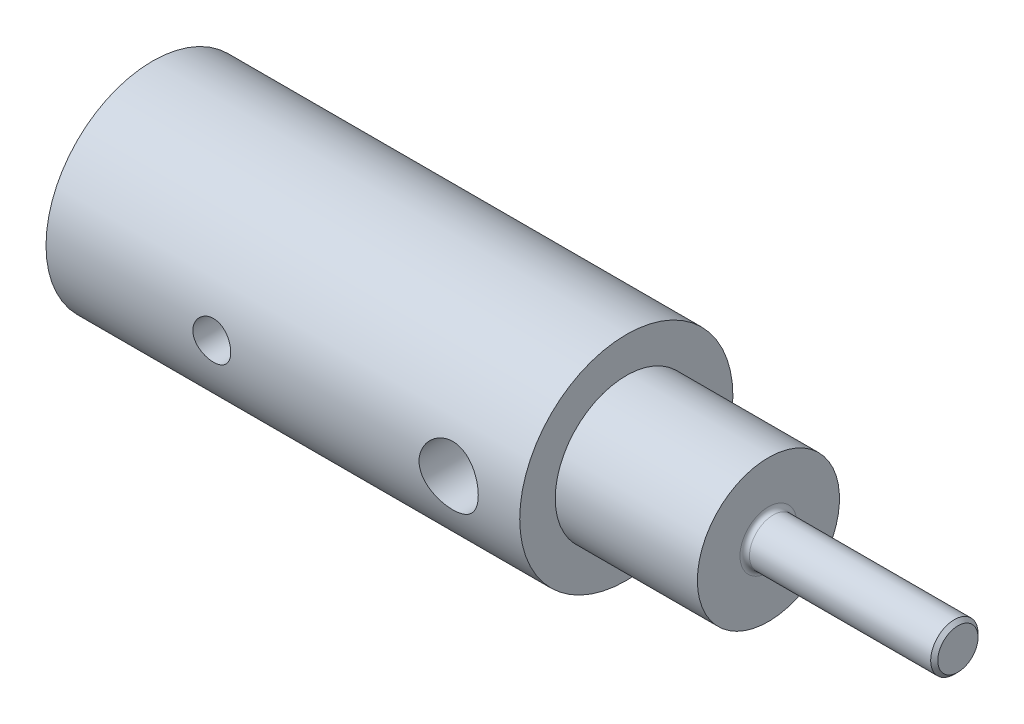
ISO-10303-21;
HEADER;
FILE_DESCRIPTION(('STEP AP214'),'2;1');
FILE_NAME('part.step','',(''),(''),'','','');
FILE_SCHEMA(('AUTOMOTIVE_DESIGN { 1 0 10303 214 1 1 1 1 }'));
ENDSEC;
DATA;
#1=APPLICATION_CONTEXT('core data for automotive mechanical design processes');
#2=APPLICATION_PROTOCOL_DEFINITION('international standard','automotive_design',2000,#1);
#3=PRODUCT_CONTEXT('',#1,'mechanical');
#4=PRODUCT('Part','Part','',(#3));
#5=PRODUCT_RELATED_PRODUCT_CATEGORY('part','',(#4));
#6=PRODUCT_DEFINITION_FORMATION('','',#4);
#7=PRODUCT_DEFINITION_CONTEXT('part definition',#1,'design');
#8=PRODUCT_DEFINITION('design','',#6,#7);
#9=PRODUCT_DEFINITION_SHAPE('','',#8);
#10=(LENGTH_UNIT() NAMED_UNIT(*) SI_UNIT(.MILLI.,.METRE.));
#11=(NAMED_UNIT(*) PLANE_ANGLE_UNIT() SI_UNIT($,.RADIAN.));
#12=(NAMED_UNIT(*) SI_UNIT($,.STERADIAN.) SOLID_ANGLE_UNIT());
#13=UNCERTAINTY_MEASURE_WITH_UNIT(LENGTH_MEASURE(1.E-05),#10,'distance_accuracy_value','');
#14=(GEOMETRIC_REPRESENTATION_CONTEXT(3) GLOBAL_UNCERTAINTY_ASSIGNED_CONTEXT((#13)) GLOBAL_UNIT_ASSIGNED_CONTEXT((#10,
#11,#12)) REPRESENTATION_CONTEXT('',''));
#15=CARTESIAN_POINT('',(0.,0.,0.));
#16=DIRECTION('',(0.,0.,1.));
#17=DIRECTION('',(1.,0.,0.));
#18=AXIS2_PLACEMENT_3D('',#15,#16,#17);
#19=CARTESIAN_POINT('',(0.,0.,0.));
#20=DIRECTION('',(-1.,0.,0.));
#21=DIRECTION('',(0.,0.,1.));
#22=AXIS2_PLACEMENT_3D('',#19,#20,#21);
#23=CYLINDRICAL_SURFACE('',#22,4.5);
#24=CARTESIAN_POINT('',(18.25,0.,-4.5));
#25=CARTESIAN_POINT('',(18.2499986004148,0.0688012508831791,-4.49999908016929));
#26=CARTESIAN_POINT('',(18.2443006801947,0.137617123752667,-4.49840674086833));
#27=CARTESIAN_POINT('',(18.2217042717347,0.273259475994238,-4.49220950198236));
#28=CARTESIAN_POINT('',(18.2048010582863,0.340085103663439,-4.48760333149253));
#29=CARTESIAN_POINT('',(18.1603912805861,0.469769949680302,-4.47588565394594));
#30=CARTESIAN_POINT('',(18.1328990313016,0.53263439009567,-4.46877753030963));
#31=CARTESIAN_POINT('',(18.0681464936731,0.652860695241773,-4.45280312581996));
#32=CARTESIAN_POINT('',(18.0308853380807,0.710222070812298,-4.44393668888688));
#33=CARTESIAN_POINT('',(17.9466705661571,0.819246784715926,-4.4251515781749));
#34=CARTESIAN_POINT('',(17.8995179603125,0.870753112808476,-4.41521373623696));
#35=CARTESIAN_POINT('',(17.7972837228784,0.96523818569634,-4.39552607117256));
#36=CARTESIAN_POINT('',(17.7422009777248,1.00821573084554,-4.38577627467017));
#37=CARTESIAN_POINT('',(17.6243927398707,1.08520808580324,-4.36737044294547));
#38=CARTESIAN_POINT('',(17.5615427915563,1.11903874947837,-4.35873847945984));
#39=CARTESIAN_POINT('',(17.4307680823599,1.1755895713114,-4.34382900808304));
#40=CARTESIAN_POINT('',(17.3628443495918,1.19831197336242,-4.33755102474248));
#41=CARTESIAN_POINT('',(17.2255972111459,1.23144924367956,-4.32825883142877));
#42=CARTESIAN_POINT('',(17.1563481783601,1.24215036904297,-4.32516886003198));
#43=CARTESIAN_POINT('',(17.0169741144372,1.25183427077973,-4.32237649384803));
#44=CARTESIAN_POINT('',(16.9468492651188,1.25081944027303,-4.3226734072502));
#45=CARTESIAN_POINT('',(16.8099777212773,1.2373267133762,-4.32655366801453));
#46=CARTESIAN_POINT('',(16.7431931985038,1.22519902270671,-4.33003660668585));
#47=CARTESIAN_POINT('',(16.6126463714084,1.19038731201905,-4.33973517053475));
#48=CARTESIAN_POINT('',(16.5488843273977,1.16770238457158,-4.3459510306134));
#49=CARTESIAN_POINT('',(16.4252977685447,1.11214373134465,-4.36050069775752));
#50=CARTESIAN_POINT('',(16.3655301331899,1.07915021836991,-4.36885918600197));
#51=CARTESIAN_POINT('',(16.2522584244088,1.00399440679636,-4.386739506843));
#52=CARTESIAN_POINT('',(16.1987556812739,0.961830166290603,-4.39626158564315));
#53=CARTESIAN_POINT('',(16.0975361195636,0.867755610284442,-4.41581072126827));
#54=CARTESIAN_POINT('',(16.0500923651201,0.815552279702357,-4.42584370037791));
#55=CARTESIAN_POINT('',(15.9645742692222,0.703806607201037,-4.44498199810828));
#56=CARTESIAN_POINT('',(15.9265003618975,0.644263925421967,-4.45408727373461));
#57=CARTESIAN_POINT('',(15.8606681843699,0.519083429338117,-4.47040839712755));
#58=CARTESIAN_POINT('',(15.8329628960611,0.45341639574775,-4.47761448645532));
#59=CARTESIAN_POINT('',(15.7890659015586,0.318109988769717,-4.48925492501446));
#60=CARTESIAN_POINT('',(15.7728714578434,0.248471564121132,-4.49368993323699));
#61=CARTESIAN_POINT('',(15.752892863221,0.109526607713143,-4.49918736483408));
#62=CARTESIAN_POINT('',(15.7487378550928,0.0402773058586817,-4.5003505382403));
#63=CARTESIAN_POINT('',(15.7519269982924,-0.0979299306365674,-4.49946480293159));
#64=CARTESIAN_POINT('',(15.759269851648,-0.166887897284519,-4.49741625678167));
#65=CARTESIAN_POINT('',(15.7849433341196,-0.30120691347086,-4.49040265059029));
#66=CARTESIAN_POINT('',(15.8030639450575,-0.366611288163867,-4.4854933716758));
#67=CARTESIAN_POINT('',(15.8495318676381,-0.49344311811872,-4.47331829169354));
#68=CARTESIAN_POINT('',(15.8778803325695,-0.554870123972382,-4.46605222488463));
#69=CARTESIAN_POINT('',(15.9446658780465,-0.673420140405416,-4.44973740284175));
#70=CARTESIAN_POINT('',(15.9833005243227,-0.730427061953541,-4.44065471340565));
#71=CARTESIAN_POINT('',(16.0693161358075,-0.837277670586999,-4.42175477128212));
#72=CARTESIAN_POINT('',(16.1166989800658,-0.887119814631375,-4.41193736105189));
#73=CARTESIAN_POINT('',(16.2206014438783,-0.979812026944952,-4.39229842684379));
#74=CARTESIAN_POINT('',(16.2773574515576,-1.02239957885383,-4.3824860820796));
#75=CARTESIAN_POINT('',(16.3974206378797,-1.09745581429008,-4.36429693304267));
#76=CARTESIAN_POINT('',(16.4607275658426,-1.12992488482463,-4.35592007387163));
#77=CARTESIAN_POINT('',(16.5918071698832,-1.18358105834153,-4.34164798956173));
#78=CARTESIAN_POINT('',(16.6595526377546,-1.20483077484783,-4.3357390309604));
#79=CARTESIAN_POINT('',(16.7978497094168,-1.23557652495357,-4.32707876892783));
#80=CARTESIAN_POINT('',(16.8684005146331,-1.24507587906573,-4.32432657344886));
#81=CARTESIAN_POINT('',(17.0076057794908,-1.25184859974322,-4.32237038329875));
#82=CARTESIAN_POINT('',(17.0762381900119,-1.24954571014582,-4.32304340461176));
#83=CARTESIAN_POINT('',(17.2120948937947,-1.23377143287258,-4.32757137052123));
#84=CARTESIAN_POINT('',(17.2793192292682,-1.22030038049411,-4.33142621959091));
#85=CARTESIAN_POINT('',(17.4098672339181,-1.18282724248615,-4.34180718808003));
#86=CARTESIAN_POINT('',(17.4732208426478,-1.15892214641117,-4.34830866913275));
#87=CARTESIAN_POINT('',(17.5950674225073,-1.10133451670734,-4.36324916052054));
#88=CARTESIAN_POINT('',(17.6535595714857,-1.06765033358688,-4.37168849767404));
#89=CARTESIAN_POINT('',(17.7660276528252,-0.990206962020973,-4.38988810785379));
#90=CARTESIAN_POINT('',(17.8198014766827,-0.946162084346267,-4.39968178982262));
#91=CARTESIAN_POINT('',(17.9193323720535,-0.849781527450664,-4.41930831909362));
#92=CARTESIAN_POINT('',(17.965087452891,-0.797443795628193,-4.4291411755031));
#93=CARTESIAN_POINT('',(18.0483581365781,-0.684460232307883,-4.44801839581548));
#94=CARTESIAN_POINT('',(18.0856516233107,-0.623646258932176,-4.45703841192791));
#95=CARTESIAN_POINT('',(18.1494281392895,-0.496361982692843,-4.47299974900605));
#96=CARTESIAN_POINT('',(18.175917518581,-0.429895030176726,-4.47994229035335));
#97=CARTESIAN_POINT('',(18.2142200807347,-0.303145483766701,-4.4901607483195));
#98=CARTESIAN_POINT('',(18.2276047875929,-0.243364402168742,-4.49382245661855));
#99=CARTESIAN_POINT('',(18.2454948458225,-0.12239262569341,-4.49874234976285));
#100=CARTESIAN_POINT('',(18.2500012449999,-0.0612020980194156,-4.50000081823467));
#101=CARTESIAN_POINT('',(18.25,0.,-4.5));
#102=B_SPLINE_CURVE_WITH_KNOTS('',3,(#24,#25,#26,#27,#28,#29,#30,#31,#32,#33,#34,#35,#36,#37,
#38,#39,#40,#41,#42,#43,#44,#45,#46,#47,#48,#49,#50,#51,#52,#53,#54,#55,#56,#57,#58,#59,#60,#61,
#62,#63,#64,#65,#66,#67,#68,#69,#70,#71,#72,#73,#74,#75,#76,#77,#78,#79,#80,#81,#82,#83,#84,#85,
#86,#87,#88,#89,#90,#91,#92,#93,#94,#95,#96,#97,#98,#99,#100,#101),.UNSPECIFIED.,.T.,.F.,(4,2,2,
2,2,2,2,2,2,2,2,2,2,2,2,2,2,2,2,2,2,2,2,2,2,2,2,2,2,2,2,2,2,2,2,2,2,2,4),(0.,0.20617919309949,
0.412445386147261,0.618433707942855,0.824440322837931,1.03507624325265,1.24574177043995,
1.46037690323672,1.67496866133384,1.88433431939189,2.09365721284145,2.29660232990422,
2.49956489399153,2.70497960040656,2.91043784592675,3.12319493838162,3.33596188658146,
3.5498016563595,3.76359055350007,3.97072010588427,4.17782627748478,4.38102317477487,
4.58424299163039,4.79168948884227,4.99918059600964,5.21305991702851,5.426931056682,
5.63959564853972,5.85220013017267,6.05722599244308,6.26224569952549,6.46539893556025,
6.66858645848129,6.87821913273771,7.0879037754062,7.30258090584733,7.51713167871719,
7.7005598652503,7.88396640253935),.UNSPECIFIED.);
#103=CARTESIAN_POINT('',(18.25,0.,-4.5));
#104=VERTEX_POINT('',#103);
#105=EDGE_CURVE('E235',#104,#104,#102,.T.);
#106=ORIENTED_EDGE('',*,*,#105,.T.);
#107=EDGE_LOOP('',(#106));
#108=FACE_BOUND('',#107,.T.);
#109=CARTESIAN_POINT('',(18.25,0.,4.5));
#110=CARTESIAN_POINT('',(18.2499986004148,-0.0688012508831791,4.49999908016929));
#111=CARTESIAN_POINT('',(18.2443006801947,-0.137617123752667,4.49840674086833));
#112=CARTESIAN_POINT('',(18.2217042717347,-0.273259475994238,4.49220950198236));
#113=CARTESIAN_POINT('',(18.2048010582863,-0.340085103663439,4.48760333149253));
#114=CARTESIAN_POINT('',(18.1603912805861,-0.469769949680302,4.47588565394594));
#115=CARTESIAN_POINT('',(18.1328990313016,-0.53263439009567,4.46877753030963));
#116=CARTESIAN_POINT('',(18.0681464936731,-0.652860695241773,4.45280312581996));
#117=CARTESIAN_POINT('',(18.0308853380807,-0.710222070812298,4.44393668888688));
#118=CARTESIAN_POINT('',(17.9466705661571,-0.819246784715924,4.4251515781749));
#119=CARTESIAN_POINT('',(17.8995179603125,-0.870753112808474,4.41521373623696));
#120=CARTESIAN_POINT('',(17.7972837228784,-0.965238185696338,4.39552607117256));
#121=CARTESIAN_POINT('',(17.7422009777248,-1.00821573084554,4.38577627467017));
#122=CARTESIAN_POINT('',(17.6243927398707,-1.08520808580323,4.36737044294547));
#123=CARTESIAN_POINT('',(17.5615427915563,-1.11903874947837,4.35873847945984));
#124=CARTESIAN_POINT('',(17.4307680823599,-1.1755895713114,4.34382900808304));
#125=CARTESIAN_POINT('',(17.3628443495918,-1.19831197336242,4.33755102474248));
#126=CARTESIAN_POINT('',(17.2255972111459,-1.23144924367956,4.32825883142877));
#127=CARTESIAN_POINT('',(17.1563481783601,-1.24215036904297,4.32516886003198));
#128=CARTESIAN_POINT('',(17.0169741144372,-1.25183427077973,4.32237649384803));
#129=CARTESIAN_POINT('',(16.9468492651188,-1.25081944027303,4.3226734072502));
#130=CARTESIAN_POINT('',(16.8099777212773,-1.2373267133762,4.32655366801453));
#131=CARTESIAN_POINT('',(16.7431931985038,-1.22519902270671,4.33003660668585));
#132=CARTESIAN_POINT('',(16.6126463714084,-1.19038731201905,4.33973517053475));
#133=CARTESIAN_POINT('',(16.5488843273977,-1.16770238457158,4.3459510306134));
#134=CARTESIAN_POINT('',(16.4252977685447,-1.11214373134465,4.36050069775752));
#135=CARTESIAN_POINT('',(16.3655301331899,-1.07915021836991,4.36885918600197));
#136=CARTESIAN_POINT('',(16.2522584244088,-1.00399440679636,4.386739506843));
#137=CARTESIAN_POINT('',(16.1987556812739,-0.961830166290603,4.39626158564315));
#138=CARTESIAN_POINT('',(16.0975361195636,-0.867755610284442,4.41581072126827));
#139=CARTESIAN_POINT('',(16.0500923651201,-0.815552279702357,4.42584370037791));
#140=CARTESIAN_POINT('',(15.9645742692222,-0.703806607201037,4.44498199810828));
#141=CARTESIAN_POINT('',(15.9265003618975,-0.644263925421967,4.45408727373461));
#142=CARTESIAN_POINT('',(15.8606681843699,-0.519083429338117,4.47040839712755));
#143=CARTESIAN_POINT('',(15.8329628960611,-0.45341639574775,4.47761448645532));
#144=CARTESIAN_POINT('',(15.7890659015586,-0.318109988769717,4.48925492501446));
#145=CARTESIAN_POINT('',(15.7728714578434,-0.248471564121132,4.49368993323699));
#146=CARTESIAN_POINT('',(15.752892863221,-0.109526607713143,4.49918736483408));
#147=CARTESIAN_POINT('',(15.7487378550928,-0.0402773058586817,4.5003505382403));
#148=CARTESIAN_POINT('',(15.7519269982924,0.0979299306365674,4.49946480293159));
#149=CARTESIAN_POINT('',(15.759269851648,0.166887897284519,4.49741625678167));
#150=CARTESIAN_POINT('',(15.7849433341196,0.30120691347086,4.49040265059029));
#151=CARTESIAN_POINT('',(15.8030639450575,0.366611288163867,4.4854933716758));
#152=CARTESIAN_POINT('',(15.8495318676381,0.49344311811872,4.47331829169354));
#153=CARTESIAN_POINT('',(15.8778803325695,0.554870123972382,4.46605222488463));
#154=CARTESIAN_POINT('',(15.9446658780465,0.673420140405416,4.44973740284175));
#155=CARTESIAN_POINT('',(15.9833005243227,0.730427061953541,4.44065471340565));
#156=CARTESIAN_POINT('',(16.0693161358075,0.837277670586999,4.42175477128212));
#157=CARTESIAN_POINT('',(16.1166989800658,0.887119814631375,4.41193736105189));
#158=CARTESIAN_POINT('',(16.2206014438783,0.979812026944952,4.39229842684379));
#159=CARTESIAN_POINT('',(16.2773574515576,1.02239957885383,4.3824860820796));
#160=CARTESIAN_POINT('',(16.3974206378797,1.09745581429008,4.36429693304267));
#161=CARTESIAN_POINT('',(16.4607275658426,1.12992488482463,4.35592007387163));
#162=CARTESIAN_POINT('',(16.5918071698832,1.18358105834153,4.34164798956173));
#163=CARTESIAN_POINT('',(16.6595526377546,1.20483077484783,4.3357390309604));
#164=CARTESIAN_POINT('',(16.7978497094168,1.23557652495357,4.32707876892783));
#165=CARTESIAN_POINT('',(16.8684005146331,1.24507587906573,4.32432657344886));
#166=CARTESIAN_POINT('',(17.0076057794908,1.25184859974322,4.32237038329875));
#167=CARTESIAN_POINT('',(17.0762381900119,1.24954571014582,4.32304340461176));
#168=CARTESIAN_POINT('',(17.2120948937947,1.23377143287258,4.32757137052123));
#169=CARTESIAN_POINT('',(17.2793192292682,1.22030038049411,4.33142621959091));
#170=CARTESIAN_POINT('',(17.4098672339181,1.18282724248615,4.34180718808003));
#171=CARTESIAN_POINT('',(17.4732208426478,1.15892214641117,4.34830866913275));
#172=CARTESIAN_POINT('',(17.5950674225073,1.10133451670734,4.36324916052054));
#173=CARTESIAN_POINT('',(17.6535595714857,1.06765033358688,4.37168849767404));
#174=CARTESIAN_POINT('',(17.7660276528252,0.990206962020973,4.38988810785379));
#175=CARTESIAN_POINT('',(17.8198014766827,0.946162084346267,4.39968178982262));
#176=CARTESIAN_POINT('',(17.9193323720535,0.849781527450664,4.41930831909362));
#177=CARTESIAN_POINT('',(17.965087452891,0.797443795628193,4.4291411755031));
#178=CARTESIAN_POINT('',(18.0483581365781,0.684460232307883,4.44801839581548));
#179=CARTESIAN_POINT('',(18.0856516233107,0.623646258932176,4.45703841192791));
#180=CARTESIAN_POINT('',(18.1494281392895,0.496361982692843,4.47299974900605));
#181=CARTESIAN_POINT('',(18.175917518581,0.429895030176726,4.47994229035335));
#182=CARTESIAN_POINT('',(18.2142200807347,0.303145483766701,4.4901607483195));
#183=CARTESIAN_POINT('',(18.2276047875929,0.243364402168742,4.49382245661855));
#184=CARTESIAN_POINT('',(18.2454948458225,0.12239262569341,4.49874234976285));
#185=CARTESIAN_POINT('',(18.2500012449999,0.0612020980194156,4.50000081823468));
#186=CARTESIAN_POINT('',(18.25,0.,4.5));
#187=B_SPLINE_CURVE_WITH_KNOTS('',3,(#109,#110,#111,#112,#113,#114,#115,#116,#117,#118,#119,
#120,#121,#122,#123,#124,#125,#126,#127,#128,#129,#130,#131,#132,#133,#134,#135,#136,#137,#138,
#139,#140,#141,#142,#143,#144,#145,#146,#147,#148,#149,#150,#151,#152,#153,#154,#155,#156,#157,
#158,#159,#160,#161,#162,#163,#164,#165,#166,#167,#168,#169,#170,#171,#172,#173,#174,#175,#176,
#177,#178,#179,#180,#181,#182,#183,#184,#185,#186),.UNSPECIFIED.,.T.,.F.,(4,2,2,2,2,2,2,2,2,2,2,
2,2,2,2,2,2,2,2,2,2,2,2,2,2,2,2,2,2,2,2,2,2,2,2,2,2,2,4),(0.,0.20617919309949,0.412445386147261,
0.618433707942855,0.824440322837931,1.03507624325264,1.24574177043995,1.46037690323672,
1.67496866133384,1.88433431939189,2.09365721284145,2.29660232990422,2.49956489399153,
2.70497960040656,2.91043784592675,3.12319493838162,3.33596188658146,3.5498016563595,
3.76359055350007,3.97072010588427,4.17782627748478,4.38102317477487,4.58424299163039,
4.79168948884227,4.99918059600964,5.21305991702851,5.426931056682,5.63959564853972,
5.85220013017267,6.05722599244308,6.26224569952549,6.46539893556025,6.66858645848129,
6.87821913273771,7.0879037754062,7.30258090584733,7.51713167871719,7.7005598652503,
7.88396640253935),.UNSPECIFIED.);
#188=CARTESIAN_POINT('',(18.25,0.,4.5));
#189=VERTEX_POINT('',#188);
#190=EDGE_CURVE('E84',#189,#189,#187,.T.);
#191=ORIENTED_EDGE('',*,*,#190,.T.);
#192=EDGE_LOOP('',(#191));
#193=FACE_BOUND('',#192,.T.);
#194=CARTESIAN_POINT('',(6.20000000000001,0.,4.5));
#195=CARTESIAN_POINT('',(6.20000174500124,0.0445599944511058,4.4999992105062));
#196=CARTESIAN_POINT('',(6.20373556648194,0.0891431869059652,4.49933127269273));
#197=CARTESIAN_POINT('',(6.21856422299493,0.177056081488532,4.49673108581177));
#198=CARTESIAN_POINT('',(6.22966553814751,0.220384645056034,4.49479772375394));
#199=CARTESIAN_POINT('',(6.25888085396563,0.304503908341068,4.48988323923955));
#200=CARTESIAN_POINT('',(6.27698880684739,0.345296761610666,4.48690302058187));
#201=CARTESIAN_POINT('',(6.31968683870222,0.423260819916551,4.48022133695395));
#202=CARTESIAN_POINT('',(6.34427628948374,0.460432375453759,4.47651994188972));
#203=CARTESIAN_POINT('',(6.39952194520398,0.530505214569471,4.46876053693121));
#204=CARTESIAN_POINT('',(6.43023460469286,0.563361649877269,4.46469942018057));
#205=CARTESIAN_POINT('',(6.49673337361036,0.623483866791267,4.45670168733634));
#206=CARTESIAN_POINT('',(6.53251982534165,0.650749270895478,4.45276507966468));
#207=CARTESIAN_POINT('',(6.60846305347863,0.699098750783088,4.44543195001283));
#208=CARTESIAN_POINT('',(6.6486489092434,0.720137812784376,4.44203943857662));
#209=CARTESIAN_POINT('',(6.73205494879309,0.755149375735973,4.4362220868588));
#210=CARTESIAN_POINT('',(6.77527489810219,0.769122422067297,4.43379717189759));
#211=CARTESIAN_POINT('',(6.86304448235446,0.789462626371859,4.43022068885813));
#212=CARTESIAN_POINT('',(6.90757553607279,0.795907629517034,4.42905609757913));
#213=CARTESIAN_POINT('',(6.9971010308134,0.801250297286223,4.42809279824557));
#214=CARTESIAN_POINT('',(7.04209543422275,0.800148569777006,4.42829398018201));
#215=CARTESIAN_POINT('',(7.13071042803527,0.790492309077643,4.43002762272544));
#216=CARTESIAN_POINT('',(7.17434096040703,0.782025776577776,4.43154436334921));
#217=CARTESIAN_POINT('',(7.25955226972143,0.758018594493089,4.43571357461903));
#218=CARTESIAN_POINT('',(7.30113296752241,0.742477672011249,4.4383660890777));
#219=CARTESIAN_POINT('',(7.38132463119045,0.704675286447835,4.44452467379717));
#220=CARTESIAN_POINT('',(7.41991825435445,0.682377806181796,4.44803529850068));
#221=CARTESIAN_POINT('',(7.49284948045757,0.631720767881608,4.45551146323876));
#222=CARTESIAN_POINT('',(7.52718669337333,0.603360654964094,4.45947704489794));
#223=CARTESIAN_POINT('',(7.59113929793212,0.540906518650161,4.46748507923883));
#224=CARTESIAN_POINT('',(7.62068108452127,0.506737111346533,4.47152782616641));
#225=CARTESIAN_POINT('',(7.67362360818996,0.433887873664048,4.47918301924728));
#226=CARTESIAN_POINT('',(7.6970242949151,0.395208006305101,4.48279546187214));
#227=CARTESIAN_POINT('',(7.73702919901549,0.314362693626078,4.48918923602904));
#228=CARTESIAN_POINT('',(7.75362631613044,0.272193661847006,4.49196969848705));
#229=CARTESIAN_POINT('',(7.77948148040013,0.185605949668321,4.49637940000599));
#230=CARTESIAN_POINT('',(7.7887402272949,0.141187484190129,4.49800874882815));
#231=CARTESIAN_POINT('',(7.79955466386688,0.0519955842873786,4.49991771582439));
#232=CARTESIAN_POINT('',(7.80121129597996,0.00723475484142859,4.50021501989789));
#233=CARTESIAN_POINT('',(7.79704445104301,-0.0819245608493668,4.49947505437087));
#234=CARTESIAN_POINT('',(7.79122130299149,-0.126323062944758,4.49843784346905));
#235=CARTESIAN_POINT('',(7.77234414258762,-0.213181265750265,4.49515637034946));
#236=CARTESIAN_POINT('',(7.75934067796172,-0.255652298730736,4.49292054923401));
#237=CARTESIAN_POINT('',(7.72652631306216,-0.337811503894585,4.48749150787854));
#238=CARTESIAN_POINT('',(7.70671498797359,-0.377499502228665,4.48429822789406));
#239=CARTESIAN_POINT('',(7.66062012846491,-0.45340053552691,4.4772644318922));
#240=CARTESIAN_POINT('',(7.63427425226624,-0.48957513227449,4.47341780117456));
#241=CARTESIAN_POINT('',(7.57594317923791,-0.557025922825162,4.46552096315961));
#242=CARTESIAN_POINT('',(7.54395751244815,-0.588301708003001,4.4614707389171));
#243=CARTESIAN_POINT('',(7.47479982524303,-0.645446143234085,4.4535652344551));
#244=CARTESIAN_POINT('',(7.43757076678499,-0.671246227953773,4.44971283774816));
#245=CARTESIAN_POINT('',(7.35924777147296,-0.716226372534343,4.44269514798421));
#246=CARTESIAN_POINT('',(7.31815396878206,-0.735406662090958,4.43952983108809));
#247=CARTESIAN_POINT('',(7.23345052489493,-0.76650296458845,4.43426684579865));
#248=CARTESIAN_POINT('',(7.1898532088758,-0.778451700039768,4.43216437529796));
#249=CARTESIAN_POINT('',(7.10122937361629,-0.794847677147893,4.42925363059009));
#250=CARTESIAN_POINT('',(7.05620299808857,-0.79929567069313,4.42844522666367));
#251=CARTESIAN_POINT('',(6.9666849115136,-0.800540742354149,4.42822025532186));
#252=CARTESIAN_POINT('',(6.92219471612174,-0.7974458568563,4.42878403402657));
#253=CARTESIAN_POINT('',(6.83437920512749,-0.783928148300325,4.43119656754119));
#254=CARTESIAN_POINT('',(6.79105388417185,-0.773505358923916,4.43304531644491));
#255=CARTESIAN_POINT('',(6.70684824695834,-0.745671304177245,4.43781159096408));
#256=CARTESIAN_POINT('',(6.66596434584432,-0.728270589949581,4.44072750237131));
#257=CARTESIAN_POINT('',(6.5876787859153,-0.686986074147885,4.44730088287819));
#258=CARTESIAN_POINT('',(6.55027733850572,-0.663101879332623,4.45095839695473));
#259=CARTESIAN_POINT('',(6.47947492702759,-0.609147973749612,4.45866451251122));
#260=CARTESIAN_POINT('',(6.4461346919219,-0.578999215356943,4.46271772160394));
#261=CARTESIAN_POINT('',(6.38495007334157,-0.513537820189473,4.47072298312656));
#262=CARTESIAN_POINT('',(6.35710695596798,-0.478223997045135,4.47467501207055));
#263=CARTESIAN_POINT('',(6.30750151094107,-0.403098638391699,4.48206940099772));
#264=CARTESIAN_POINT('',(6.28578944198533,-0.363253483491107,4.48550744558468));
#265=CARTESIAN_POINT('',(6.24940142099613,-0.280434482871198,4.49144447674611));
#266=CARTESIAN_POINT('',(6.23471866721443,-0.23746370816299,4.49394437059121));
#267=CARTESIAN_POINT('',(6.21588678482421,-0.161955352943685,4.49719641064708));
#268=CARTESIAN_POINT('',(6.20993911022775,-0.129866914867117,4.49824197346458));
#269=CARTESIAN_POINT('',(6.20199512143958,-0.0651897831779776,4.4996440496288));
#270=CARTESIAN_POINT('',(6.19999872331762,-0.032601100206077,4.50000057761152));
#271=CARTESIAN_POINT('',(6.20000000000001,0.,4.5));
#272=B_SPLINE_CURVE_WITH_KNOTS('',3,(#194,#195,#196,#197,#198,#199,#200,#201,#202,#203,#204,
#205,#206,#207,#208,#209,#210,#211,#212,#213,#214,#215,#216,#217,#218,#219,#220,#221,#222,#223,
#224,#225,#226,#227,#228,#229,#230,#231,#232,#233,#234,#235,#236,#237,#238,#239,#240,#241,#242,
#243,#244,#245,#246,#247,#248,#249,#250,#251,#252,#253,#254,#255,#256,#257,#258,#259,#260,#261,
#262,#263,#264,#265,#266,#267,#268,#269,#270,#271),.UNSPECIFIED.,.T.,.F.,(4,2,2,2,2,2,2,2,2,2,2,
2,2,2,2,2,2,2,2,2,2,2,2,2,2,2,2,2,2,2,2,2,2,2,2,2,2,2,4),(0.,0.133560787307614,
0.267239204719188,0.400802493989525,0.534352842964275,0.669196734750359,0.804049728093324,
0.939855083372446,1.07564995509549,1.21002782142156,1.34439486413637,1.4771780973117,
1.60996645307989,1.74347550247011,1.87699677653181,2.01240541123725,2.14781515620096,
2.28336585829403,2.41890363358383,2.55263640156711,2.68636328750941,2.81916055309513,
2.95196610682171,3.08609099284346,3.22022706069195,3.35595479969539,3.49167782870151,
3.6267820327491,3.76187269289278,3.89503985407062,4.02820640316768,4.16117234921644,
4.29414636182435,4.42891302912826,4.56371069989326,4.69958324903566,4.83532405729453,
4.9330422270718,5.03075832116593),.UNSPECIFIED.);
#273=CARTESIAN_POINT('',(6.20000000000001,0.,4.5));
#274=VERTEX_POINT('',#273);
#275=EDGE_CURVE('E77',#274,#274,#272,.T.);
#276=ORIENTED_EDGE('',*,*,#275,.T.);
#277=EDGE_LOOP('',(#276));
#278=FACE_BOUND('',#277,.T.);
#279=CARTESIAN_POINT('',(0.,0.,0.));
#280=DIRECTION('',(-1.,0.,0.));
#281=DIRECTION('',(0.,0.,1.));
#282=AXIS2_PLACEMENT_3D('',#279,#280,#281);
#283=CIRCLE('',#282,4.5);
#284=CARTESIAN_POINT('',(0.,0.,4.5));
#285=VERTEX_POINT('',#284);
#286=EDGE_CURVE('E62',#285,#285,#283,.T.);
#287=ORIENTED_EDGE('',*,*,#286,.F.);
#288=EDGE_LOOP('',(#287));
#289=FACE_BOUND('',#288,.T.);
#290=CARTESIAN_POINT('',(20.,0.,0.));
#291=DIRECTION('',(-1.,0.,0.));
#292=DIRECTION('',(0.,0.,1.));
#293=AXIS2_PLACEMENT_3D('',#290,#291,#292);
#294=CIRCLE('',#293,4.5);
#295=CARTESIAN_POINT('',(20.,0.,4.5));
#296=VERTEX_POINT('',#295);
#297=EDGE_CURVE('E109',#296,#296,#294,.T.);
#298=ORIENTED_EDGE('',*,*,#297,.T.);
#299=EDGE_LOOP('',(#298));
#300=FACE_BOUND('',#299,.T.);
#301=ADVANCED_FACE('F38',(#108,#193,#278,#289,#300),#23,.T.);
#302=CARTESIAN_POINT('',(0.,4.5,0.));
#303=DIRECTION('',(1.,0.,0.));
#304=DIRECTION('',(0.,0.,-1.));
#305=AXIS2_PLACEMENT_3D('',#302,#303,#304);
#306=PLANE('',#305);
#307=CARTESIAN_POINT('',(0.,0.,0.));
#308=DIRECTION('',(-1.,0.,0.));
#309=DIRECTION('',(0.,0.,1.));
#310=AXIS2_PLACEMENT_3D('',#307,#308,#309);
#311=CIRCLE('',#310,2.);
#312=CARTESIAN_POINT('',(0.,0.,2.));
#313=VERTEX_POINT('',#312);
#314=EDGE_CURVE('E58',#313,#313,#311,.T.);
#315=ORIENTED_EDGE('',*,*,#314,.F.);
#316=EDGE_LOOP('',(#315));
#317=FACE_BOUND('',#316,.T.);
#318=ORIENTED_EDGE('',*,*,#286,.T.);
#319=EDGE_LOOP('',(#318));
#320=FACE_BOUND('',#319,.T.);
#321=ADVANCED_FACE('F112',(#317,#320),#306,.F.);
#322=CARTESIAN_POINT('',(0.,0.,0.));
#323=DIRECTION('',(-1.,0.,0.));
#324=DIRECTION('',(0.,0.,1.));
#325=AXIS2_PLACEMENT_3D('',#322,#323,#324);
#326=CYLINDRICAL_SURFACE('',#325,2.);
#327=CARTESIAN_POINT('',(7.79999999999999,0.,2.));
#328=CARTESIAN_POINT('',(7.7999960592705,0.0429972021771562,1.99999708490834));
#329=CARTESIAN_POINT('',(7.79651289916464,0.0860690256362687,1.99859717722773));
#330=CARTESIAN_POINT('',(7.7827009185915,0.170998592167157,1.99313381240257));
#331=CARTESIAN_POINT('',(7.77235348836554,0.212852711024498,1.98906311479551));
#332=CARTESIAN_POINT('',(7.74524956877646,0.293981569090959,1.97869683685247));
#333=CARTESIAN_POINT('',(7.7285140615133,0.333264264646781,1.97240854545629));
#334=CARTESIAN_POINT('',(7.68919233066938,0.408428788131344,1.95822644318431));
#335=CARTESIAN_POINT('',(7.66660813803242,0.444311790700394,1.95033318983223));
#336=CARTESIAN_POINT('',(7.61510580057562,0.513400403028154,1.93332354468168));
#337=CARTESIAN_POINT('',(7.58595733750389,0.546424909020082,1.92416918771676));
#338=CARTESIAN_POINT('',(7.52263999860928,0.607270001913885,1.90584230762478));
#339=CARTESIAN_POINT('',(7.4884686811153,0.635088042853408,1.89666977781517));
#340=CARTESIAN_POINT('',(7.41422877190309,0.685949826917146,1.87889116718855));
#341=CARTESIAN_POINT('',(7.37396540559072,0.708725992478184,1.87032846385981));
#342=CARTESIAN_POINT('',(7.28978544063198,0.747101887614854,1.85533458874717));
#343=CARTESIAN_POINT('',(7.24587058886065,0.762705025714328,1.84890240497671));
#344=CARTESIAN_POINT('',(7.15771506656316,0.785559529358341,1.83930543064328));
#345=CARTESIAN_POINT('',(7.11357950576951,0.793157586322253,1.83600568142242));
#346=CARTESIAN_POINT('',(7.02454600067709,0.800869184656005,1.83265601619658));
#347=CARTESIAN_POINT('',(6.97964844214999,0.800986406525282,1.83260450209108));
#348=CARTESIAN_POINT('',(6.89369733141678,0.793995747001811,1.83564200111998));
#349=CARTESIAN_POINT('',(6.85259371423639,0.787390125722048,1.8385127001538));
#350=CARTESIAN_POINT('',(6.77213617759732,0.767978752119121,1.84670475043135));
#351=CARTESIAN_POINT('',(6.73278256475588,0.755171917921846,1.85202652928669));
#352=CARTESIAN_POINT('',(6.65599286552159,0.723477893020422,1.86463794035412));
#353=CARTESIAN_POINT('',(6.61861230437813,0.70447194492612,1.87196551712315));
#354=CARTESIAN_POINT('',(6.54743367345538,0.661002584292879,1.88775246555956));
#355=CARTESIAN_POINT('',(6.51363695623888,0.636537122040331,1.8962122618274));
#356=CARTESIAN_POINT('',(6.4478361084792,0.580620239781768,1.91410694696908));
#357=CARTESIAN_POINT('',(6.4161725082216,0.548774985188249,1.92356665990461));
#358=CARTESIAN_POINT('',(6.35852620879919,0.480125770972073,1.94183929983313));
#359=CARTESIAN_POINT('',(6.33254464103589,0.443320826133769,1.9506520977813));
#360=CARTESIAN_POINT('',(6.28655302103367,0.364831061042333,1.96685872505819));
#361=CARTESIAN_POINT('',(6.26667108752118,0.323064196538587,1.97422108038166));
#362=CARTESIAN_POINT('',(6.23433285556878,0.236409506193149,1.98645931331504));
#363=CARTESIAN_POINT('',(6.22187278497704,0.191523278739867,1.99133645384953));
#364=CARTESIAN_POINT('',(6.20542068183212,0.102758355043126,1.99782455802764));
#365=CARTESIAN_POINT('',(6.20097101829858,0.0589773175942121,1.99961178333406));
#366=CARTESIAN_POINT('',(6.19931475978856,-0.0287381239231278,2.00027391404252));
#367=CARTESIAN_POINT('',(6.202106287381,-0.07267248528957,1.99914957432917));
#368=CARTESIAN_POINT('',(6.2145167010208,-0.157373095648795,1.99423026825501));
#369=CARTESIAN_POINT('',(6.2238231921404,-0.198192996710189,1.99055756538209));
#370=CARTESIAN_POINT('',(6.24857428332393,-0.277654171224311,1.981037765622));
#371=CARTESIAN_POINT('',(6.26401967186748,-0.316295164089937,1.97519038942612));
#372=CARTESIAN_POINT('',(6.30111397587199,-0.391631514326679,1.96166637908325));
#373=CARTESIAN_POINT('',(6.32293818881726,-0.42823120910216,1.95393926391921));
#374=CARTESIAN_POINT('',(6.37197612956226,-0.497377436498619,1.9374934589821));
#375=CARTESIAN_POINT('',(6.39919201716905,-0.529922336304447,1.92877437244108));
#376=CARTESIAN_POINT('',(6.46034800517986,-0.592289217211524,1.91058047055245));
#377=CARTESIAN_POINT('',(6.49461341660249,-0.621789573522422,1.90109376570021));
#378=CARTESIAN_POINT('',(6.56777603320375,-0.67470047896548,1.88296669166853));
#379=CARTESIAN_POINT('',(6.60667400013598,-0.698110024534999,1.87432646210604));
#380=CARTESIAN_POINT('',(6.68858467783765,-0.738323000772646,1.85885719963084));
#381=CARTESIAN_POINT('',(6.73163359968493,-0.755060237813776,1.85204652353915));
#382=CARTESIAN_POINT('',(6.82029346068607,-0.780918487882116,1.84129469391173));
#383=CARTESIAN_POINT('',(6.86590248232497,-0.79004512210772,1.837351422784));
#384=CARTESIAN_POINT('',(6.95485116070982,-0.799886246911354,1.83308703719971));
#385=CARTESIAN_POINT('',(6.99811793583734,-0.80115883292114,1.83252568403269));
#386=CARTESIAN_POINT('',(7.08421794308532,-0.796721263711003,1.83445934413239));
#387=CARTESIAN_POINT('',(7.12705122956103,-0.791011995165506,1.83695396929918));
#388=CARTESIAN_POINT('',(7.20933287594202,-0.773228546461452,1.84450659631609));
#389=CARTESIAN_POINT('',(7.2488481097732,-0.761414997428384,1.8494593273098));
#390=CARTESIAN_POINT('',(7.32535145184539,-0.732002179396398,1.86129600493079));
#391=CARTESIAN_POINT('',(7.36233885875993,-0.714401312557518,1.86818048482403));
#392=CARTESIAN_POINT('',(7.43504384770831,-0.672749105103885,1.88359443841797));
#393=CARTESIAN_POINT('',(7.47056746805219,-0.648386134063789,1.89219552925297));
#394=CARTESIAN_POINT('',(7.5371973268815,-0.594356847708591,1.90985521748895));
#395=CARTESIAN_POINT('',(7.56830222885132,-0.564688933927242,1.91891395219363));
#396=CARTESIAN_POINT('',(7.62728114130544,-0.498602202508978,1.93717426834958));
#397=CARTESIAN_POINT('',(7.65481492275922,-0.461870400458449,1.94634703184874));
#398=CARTESIAN_POINT('',(7.70333481704865,-0.383960128114306,1.96320162685487));
#399=CARTESIAN_POINT('',(7.72431788486101,-0.34277960181889,1.97088276437163));
#400=CARTESIAN_POINT('',(7.75864888607611,-0.257895224998077,1.98375885926345));
#401=CARTESIAN_POINT('',(7.77213172942413,-0.214252647287874,1.98899745222011));
#402=CARTESIAN_POINT('',(7.7914556483817,-0.125150618512485,1.99657722483746));
#403=CARTESIAN_POINT('',(7.79732097469755,-0.0796974103435622,1.99892759798255));
#404=CARTESIAN_POINT('',(7.7997581523913,-0.0227649191563701,1.99990359801655));
#405=CARTESIAN_POINT('',(7.80000104345167,-0.0113850754963024,2.0000007718767));
#406=CARTESIAN_POINT('',(7.79999999999999,0.,2.));
#407=B_SPLINE_CURVE_WITH_KNOTS('',3,(#327,#328,#329,#330,#331,#332,#333,#334,#335,#336,#337,
#338,#339,#340,#341,#342,#343,#344,#345,#346,#347,#348,#349,#350,#351,#352,#353,#354,#355,#356,
#357,#358,#359,#360,#361,#362,#363,#364,#365,#366,#367,#368,#369,#370,#371,#372,#373,#374,#375,
#376,#377,#378,#379,#380,#381,#382,#383,#384,#385,#386,#387,#388,#389,#390,#391,#392,#393,#394,
#395,#396,#397,#398,#399,#400,#401,#402,#403,#404,#405,#406),.UNSPECIFIED.,.T.,.F.,(4,2,2,2,2,2,
2,2,2,2,2,2,2,2,2,2,2,2,2,2,2,2,2,2,2,2,2,2,2,2,2,2,2,2,2,2,2,2,2,4),(0.,0.128961195157228,
0.258273454403172,0.387164582988629,0.516011014271933,0.650389526801584,0.78483357973764,
0.925261035276861,1.06562169247306,1.19961642123531,1.33354522536194,1.45815331360548,
1.58278314902418,1.70995650519525,1.83717768775272,1.97423339674621,2.11131637135891,
2.25110765265121,2.39082782445514,2.52227673811201,2.65369157428031,2.77920182225744,
2.90472819597516,3.03409405359303,3.16351183799585,3.30147389849763,3.43945867617497,
3.57878018056328,3.71799869058371,3.84719869357096,3.97638229025215,4.10045727419504,
4.22456654322061,4.35578187222673,4.48703680539354,4.62680169413531,4.76663145456209,
4.90385720405323,5.04064500961733,5.07479218358714),.UNSPECIFIED.);
#408=CARTESIAN_POINT('',(7.79999999999999,0.,2.));
#409=VERTEX_POINT('',#408);
#410=EDGE_CURVE('E103',#409,#409,#407,.T.);
#411=ORIENTED_EDGE('',*,*,#410,.T.);
#412=EDGE_LOOP('',(#411));
#413=FACE_BOUND('',#412,.T.);
#414=CARTESIAN_POINT('',(14.,0.,0.));
#415=DIRECTION('',(-1.,0.,0.));
#416=DIRECTION('',(0.,0.,1.));
#417=AXIS2_PLACEMENT_3D('',#414,#415,#416);
#418=CIRCLE('',#417,2.);
#419=CARTESIAN_POINT('',(14.,0.,2.));
#420=VERTEX_POINT('',#419);
#421=EDGE_CURVE('E56',#420,#420,#418,.T.);
#422=ORIENTED_EDGE('',*,*,#421,.F.);
#423=EDGE_LOOP('',(#422));
#424=FACE_BOUND('',#423,.T.);
#425=ORIENTED_EDGE('',*,*,#314,.T.);
#426=EDGE_LOOP('',(#425));
#427=FACE_BOUND('',#426,.T.);
#428=ADVANCED_FACE('F52',(#413,#424,#427),#326,.F.);
#429=CARTESIAN_POINT('',(14.,0.,0.));
#430=DIRECTION('',(-1.,0.,0.));
#431=DIRECTION('',(0.,0.,1.));
#432=AXIS2_PLACEMENT_3D('',#429,#430,#431);
#433=CONICAL_SURFACE('',#432,2.,1.02974425867666);
#434=CARTESIAN_POINT('',(15.2017212380551,0.,0.));
#435=VERTEX_POINT('',#434);
#436=VERTEX_LOOP('',#435);
#437=FACE_BOUND('',#436,.T.);
#438=ORIENTED_EDGE('',*,*,#421,.T.);
#439=EDGE_LOOP('',(#438));
#440=FACE_BOUND('',#439,.T.);
#441=ADVANCED_FACE('F48',(#437,#440),#433,.F.);
#442=CARTESIAN_POINT('',(34.,1.,0.));
#443=DIRECTION('',(-1.,0.,0.));
#444=DIRECTION('',(0.,0.,1.));
#445=AXIS2_PLACEMENT_3D('',#442,#443,#444);
#446=PLANE('',#445);
#447=CARTESIAN_POINT('',(34.,0.,0.));
#448=DIRECTION('',(-1.,0.,0.));
#449=DIRECTION('',(0.,0.,1.));
#450=AXIS2_PLACEMENT_3D('',#447,#448,#449);
#451=CIRCLE('',#450,0.849999999999997);
#452=CARTESIAN_POINT('',(34.,0.,0.849999999999997));
#453=VERTEX_POINT('',#452);
#454=EDGE_CURVE('E74',#453,#453,#451,.F.);
#455=ORIENTED_EDGE('',*,*,#454,.T.);
#456=EDGE_LOOP('',(#455));
#457=FACE_BOUND('',#456,.T.);
#458=ADVANCED_FACE('F51',(#457),#446,.F.);
#459=CARTESIAN_POINT('',(0.,0.,0.));
#460=DIRECTION('',(-1.,0.,0.));
#461=DIRECTION('',(0.,0.,1.));
#462=AXIS2_PLACEMENT_3D('',#459,#460,#461);
#463=CYLINDRICAL_SURFACE('',#462,1.);
#464=CARTESIAN_POINT('',(26.2,0.,0.));
#465=DIRECTION('',(-1.,0.,0.));
#466=DIRECTION('',(0.,0.,1.));
#467=AXIS2_PLACEMENT_3D('',#464,#465,#466);
#468=CIRCLE('',#467,1.);
#469=CARTESIAN_POINT('',(26.2,0.,1.));
#470=VERTEX_POINT('',#469);
#471=EDGE_CURVE('E11',#470,#470,#468,.F.);
#472=ORIENTED_EDGE('',*,*,#471,.T.);
#473=EDGE_LOOP('',(#472));
#474=FACE_BOUND('',#473,.T.);
#475=CARTESIAN_POINT('',(33.85,0.,0.));
#476=DIRECTION('',(-1.,0.,0.));
#477=DIRECTION('',(0.,0.,1.));
#478=AXIS2_PLACEMENT_3D('',#475,#476,#477);
#479=CIRCLE('',#478,1.);
#480=CARTESIAN_POINT('',(33.85,0.,1.));
#481=VERTEX_POINT('',#480);
#482=EDGE_CURVE('E71',#481,#481,#479,.T.);
#483=ORIENTED_EDGE('',*,*,#482,.T.);
#484=EDGE_LOOP('',(#483));
#485=FACE_BOUND('',#484,.T.);
#486=ADVANCED_FACE('F140',(#474,#485),#463,.T.);
#487=CARTESIAN_POINT('',(26.,1.,0.));
#488=DIRECTION('',(-1.,0.,0.));
#489=DIRECTION('',(0.,0.,1.));
#490=AXIS2_PLACEMENT_3D('',#487,#488,#489);
#491=PLANE('',#490);
#492=CARTESIAN_POINT('',(26.,0.,0.));
#493=DIRECTION('',(-1.,0.,0.));
#494=DIRECTION('',(0.,0.,1.));
#495=AXIS2_PLACEMENT_3D('',#492,#493,#494);
#496=CIRCLE('',#495,1.2);
#497=CARTESIAN_POINT('',(26.,0.,1.2));
#498=VERTEX_POINT('',#497);
#499=EDGE_CURVE('E45',#498,#498,#496,.T.);
#500=ORIENTED_EDGE('',*,*,#499,.T.);
#501=EDGE_LOOP('',(#500));
#502=FACE_BOUND('',#501,.T.);
#503=CARTESIAN_POINT('',(26.,0.,0.));
#504=DIRECTION('',(-1.,0.,0.));
#505=DIRECTION('',(0.,0.,1.));
#506=AXIS2_PLACEMENT_3D('',#503,#504,#505);
#507=CIRCLE('',#506,3.);
#508=CARTESIAN_POINT('',(26.,0.,3.));
#509=VERTEX_POINT('',#508);
#510=EDGE_CURVE('E59',#509,#509,#507,.T.);
#511=ORIENTED_EDGE('',*,*,#510,.F.);
#512=EDGE_LOOP('',(#511));
#513=FACE_BOUND('',#512,.T.);
#514=ADVANCED_FACE('F136',(#502,#513),#491,.F.);
#515=CARTESIAN_POINT('',(0.,0.,0.));
#516=DIRECTION('',(-1.,0.,0.));
#517=DIRECTION('',(0.,0.,1.));
#518=AXIS2_PLACEMENT_3D('',#515,#516,#517);
#519=CYLINDRICAL_SURFACE('',#518,3.);
#520=CARTESIAN_POINT('',(20.,0.,0.));
#521=DIRECTION('',(-1.,0.,0.));
#522=DIRECTION('',(0.,0.,1.));
#523=AXIS2_PLACEMENT_3D('',#520,#521,#522);
#524=CIRCLE('',#523,3.);
#525=CARTESIAN_POINT('',(20.,0.,3.));
#526=VERTEX_POINT('',#525);
#527=EDGE_CURVE('E65',#526,#526,#524,.T.);
#528=ORIENTED_EDGE('',*,*,#527,.F.);
#529=EDGE_LOOP('',(#528));
#530=FACE_BOUND('',#529,.T.);
#531=ORIENTED_EDGE('',*,*,#510,.T.);
#532=EDGE_LOOP('',(#531));
#533=FACE_BOUND('',#532,.T.);
#534=ADVANCED_FACE('F133',(#530,#533),#519,.T.);
#535=CARTESIAN_POINT('',(20.,3.,0.));
#536=DIRECTION('',(-1.,0.,0.));
#537=DIRECTION('',(0.,0.,1.));
#538=AXIS2_PLACEMENT_3D('',#535,#536,#537);
#539=PLANE('',#538);
#540=ORIENTED_EDGE('',*,*,#297,.F.);
#541=EDGE_LOOP('',(#540));
#542=FACE_BOUND('',#541,.T.);
#543=ORIENTED_EDGE('',*,*,#527,.T.);
#544=EDGE_LOOP('',(#543));
#545=FACE_BOUND('',#544,.T.);
#546=ADVANCED_FACE('F99',(#542,#545),#539,.F.);
#547=CARTESIAN_POINT('',(33.85,0.,0.));
#548=DIRECTION('',(-1.,0.,0.));
#549=DIRECTION('',(0.,0.,1.));
#550=AXIS2_PLACEMENT_3D('',#547,#548,#549);
#551=CONICAL_SURFACE('',#550,1.,0.785398163397468);
#552=ORIENTED_EDGE('',*,*,#454,.F.);
#553=EDGE_LOOP('',(#552));
#554=FACE_BOUND('',#553,.T.);
#555=ORIENTED_EDGE('',*,*,#482,.F.);
#556=EDGE_LOOP('',(#555));
#557=FACE_BOUND('',#556,.T.);
#558=ADVANCED_FACE('F96',(#554,#557),#551,.T.);
#559=CARTESIAN_POINT('',(7.,0.,0.));
#560=DIRECTION('',(0.,0.,-1.));
#561=DIRECTION('',(-1.,0.,0.));
#562=AXIS2_PLACEMENT_3D('',#559,#560,#561);
#563=CYLINDRICAL_SURFACE('',#562,0.799999999999993);
#564=ORIENTED_EDGE('',*,*,#275,.F.);
#565=EDGE_LOOP('',(#564));
#566=FACE_BOUND('',#565,.T.);
#567=ORIENTED_EDGE('',*,*,#410,.F.);
#568=EDGE_LOOP('',(#567));
#569=FACE_BOUND('',#568,.T.);
#570=ADVANCED_FACE('F91',(#566,#569),#563,.F.);
#571=CARTESIAN_POINT('',(17.,0.,-4.5));
#572=DIRECTION('',(0.,0.,1.));
#573=DIRECTION('',(1.,0.,0.));
#574=AXIS2_PLACEMENT_3D('',#571,#572,#573);
#575=CYLINDRICAL_SURFACE('',#574,1.25);
#576=ORIENTED_EDGE('',*,*,#190,.F.);
#577=EDGE_LOOP('',(#576));
#578=FACE_BOUND('',#577,.T.);
#579=ORIENTED_EDGE('',*,*,#105,.F.);
#580=EDGE_LOOP('',(#579));
#581=FACE_BOUND('',#580,.T.);
#582=ADVANCED_FACE('F95',(#578,#581),#575,.F.);
#583=CARTESIAN_POINT('',(26.2,0.,0.));
#584=DIRECTION('',(-1.,0.,0.));
#585=DIRECTION('',(0.,0.,1.));
#586=AXIS2_PLACEMENT_3D('',#583,#584,#585);
#587=TOROIDAL_SURFACE('',#586,1.2,0.2);
#588=ORIENTED_EDGE('',*,*,#471,.F.);
#589=EDGE_LOOP('',(#588));
#590=FACE_BOUND('',#589,.T.);
#591=ORIENTED_EDGE('',*,*,#499,.F.);
#592=EDGE_LOOP('',(#591));
#593=FACE_BOUND('',#592,.T.);
#594=ADVANCED_FACE('F40',(#590,#593),#587,.F.);
#595=CLOSED_SHELL('',(#301,#321,#428,#441,#458,#486,#514,#534,#546,#558,#570,#582,#594));
#596=MANIFOLD_SOLID_BREP('B2',#595);
#597=ADVANCED_BREP_SHAPE_REPRESENTATION('',(#18,#596),#14);
#598=SHAPE_DEFINITION_REPRESENTATION(#9,#597);
ENDSEC;
END-ISO-10303-21;
